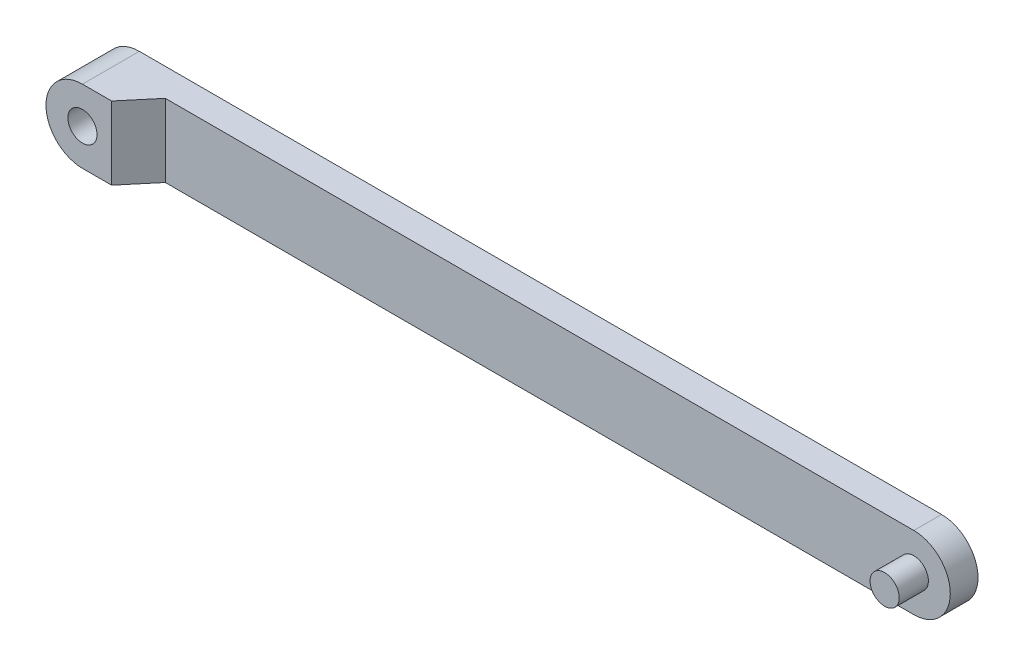
ISO-10303-21;
HEADER;
FILE_DESCRIPTION(('STEP AP214'),'2;1');
FILE_NAME('part.step','',(''),(''),'','','');
FILE_SCHEMA(('AUTOMOTIVE_DESIGN { 1 0 10303 214 1 1 1 1 }'));
ENDSEC;
DATA;
#1=APPLICATION_CONTEXT('core data for automotive mechanical design processes');
#2=APPLICATION_PROTOCOL_DEFINITION('international standard','automotive_design',2000,#1);
#3=PRODUCT_CONTEXT('',#1,'mechanical');
#4=PRODUCT('Part','Part','',(#3));
#5=PRODUCT_RELATED_PRODUCT_CATEGORY('part','',(#4));
#6=PRODUCT_DEFINITION_FORMATION('','',#4);
#7=PRODUCT_DEFINITION_CONTEXT('part definition',#1,'design');
#8=PRODUCT_DEFINITION('design','',#6,#7);
#9=PRODUCT_DEFINITION_SHAPE('','',#8);
#10=(LENGTH_UNIT() NAMED_UNIT(*) SI_UNIT(.MILLI.,.METRE.));
#11=(NAMED_UNIT(*) PLANE_ANGLE_UNIT() SI_UNIT($,.RADIAN.));
#12=(NAMED_UNIT(*) SI_UNIT($,.STERADIAN.) SOLID_ANGLE_UNIT());
#13=UNCERTAINTY_MEASURE_WITH_UNIT(LENGTH_MEASURE(1.E-05),#10,'distance_accuracy_value','');
#14=(GEOMETRIC_REPRESENTATION_CONTEXT(3) GLOBAL_UNCERTAINTY_ASSIGNED_CONTEXT((#13)) GLOBAL_UNIT_ASSIGNED_CONTEXT((#10,
#11,#12)) REPRESENTATION_CONTEXT('',''));
#15=CARTESIAN_POINT('',(0.,0.,0.));
#16=DIRECTION('',(0.,0.,1.));
#17=DIRECTION('',(1.,0.,0.));
#18=AXIS2_PLACEMENT_3D('',#15,#16,#17);
#19=CARTESIAN_POINT('',(-293.390996311773,0.,29.5));
#20=DIRECTION('',(0.,0.,1.));
#21=DIRECTION('',(1.,0.,0.));
#22=AXIS2_PLACEMENT_3D('',#19,#20,#21);
#23=PLANE('',#22);
#24=DIRECTION('',(0.,-1.,0.));
#25=VECTOR('',#24,1.);
#26=CARTESIAN_POINT('',(-273.390996311773,25.,29.5));
#27=LINE('',#26,#25);
#28=CARTESIAN_POINT('',(-273.390996311773,25.,29.5));
#29=VERTEX_POINT('',#28);
#30=CARTESIAN_POINT('',(-273.390996311773,-25.,29.5));
#31=VERTEX_POINT('',#30);
#32=EDGE_CURVE('E117',#29,#31,#27,.T.);
#33=ORIENTED_EDGE('',*,*,#32,.F.);
#34=DIRECTION('',(-1.,0.,0.));
#35=VECTOR('',#34,1.);
#36=CARTESIAN_POINT('',(-293.390996311773,25.,29.5));
#37=LINE('',#36,#35);
#38=CARTESIAN_POINT('',(-293.390996311773,25.,29.5));
#39=VERTEX_POINT('',#38);
#40=EDGE_CURVE('E40',#29,#39,#37,.T.);
#41=ORIENTED_EDGE('',*,*,#40,.T.);
#42=CARTESIAN_POINT('',(-293.390996311773,0.,29.5));
#43=DIRECTION('',(0.,0.,1.));
#44=DIRECTION('',(1.,0.,0.));
#45=AXIS2_PLACEMENT_3D('',#42,#43,#44);
#46=CIRCLE('',#45,25.);
#47=CARTESIAN_POINT('',(-293.390996311773,-25.,29.5));
#48=VERTEX_POINT('',#47);
#49=EDGE_CURVE('E71',#39,#48,#46,.T.);
#50=ORIENTED_EDGE('',*,*,#49,.T.);
#51=DIRECTION('',(1.,0.,0.));
#52=VECTOR('',#51,1.);
#53=CARTESIAN_POINT('',(-293.390996311773,-25.,29.5));
#54=LINE('',#53,#52);
#55=EDGE_CURVE('E103',#48,#31,#54,.T.);
#56=ORIENTED_EDGE('',*,*,#55,.T.);
#57=EDGE_LOOP('',(#33,#41,#50,#56));
#58=FACE_BOUND('',#57,.T.);
#59=CARTESIAN_POINT('',(-293.390996311773,0.,29.5));
#60=DIRECTION('',(0.,0.,1.));
#61=DIRECTION('',(1.,0.,0.));
#62=AXIS2_PLACEMENT_3D('',#59,#60,#61);
#63=CIRCLE('',#62,9.99999999999998);
#64=CARTESIAN_POINT('',(-283.390996311773,0.,29.5));
#65=VERTEX_POINT('',#64);
#66=EDGE_CURVE('E83',#65,#65,#63,.T.);
#67=ORIENTED_EDGE('',*,*,#66,.F.);
#68=EDGE_LOOP('',(#67));
#69=FACE_BOUND('',#68,.T.);
#70=ADVANCED_FACE('F16',(#58,#69),#23,.T.);
#71=CARTESIAN_POINT('',(-293.390996311773,0.,-9.49999999999999));
#72=DIRECTION('',(0.,0.,1.));
#73=DIRECTION('',(1.,0.,0.));
#74=AXIS2_PLACEMENT_3D('',#71,#72,#73);
#75=PLANE('',#74);
#76=CARTESIAN_POINT('',(-293.390996311773,0.,-9.49999999999999));
#77=DIRECTION('',(0.,0.,1.));
#78=DIRECTION('',(1.,0.,0.));
#79=AXIS2_PLACEMENT_3D('',#76,#77,#78);
#80=CIRCLE('',#79,25.);
#81=CARTESIAN_POINT('',(-293.390996311773,25.,-9.49999999999999));
#82=VERTEX_POINT('',#81);
#83=CARTESIAN_POINT('',(-293.390996311773,-25.,-9.49999999999999));
#84=VERTEX_POINT('',#83);
#85=EDGE_CURVE('E77',#82,#84,#80,.T.);
#86=ORIENTED_EDGE('',*,*,#85,.F.);
#87=DIRECTION('',(-1.,0.,0.));
#88=VECTOR('',#87,1.);
#89=CARTESIAN_POINT('',(-293.390996311773,25.,-9.49999999999999));
#90=LINE('',#89,#88);
#91=CARTESIAN_POINT('',(256.609003688227,25.,-9.49999999999999));
#92=VERTEX_POINT('',#91);
#93=EDGE_CURVE('E59',#92,#82,#90,.T.);
#94=ORIENTED_EDGE('',*,*,#93,.F.);
#95=CARTESIAN_POINT('',(256.609003688227,0.,-9.49999999999999));
#96=DIRECTION('',(0.,0.,1.));
#97=DIRECTION('',(1.,0.,0.));
#98=AXIS2_PLACEMENT_3D('',#95,#96,#97);
#99=CIRCLE('',#98,25.);
#100=CARTESIAN_POINT('',(256.609003688227,-25.,-9.49999999999999));
#101=VERTEX_POINT('',#100);
#102=EDGE_CURVE('E72',#101,#92,#99,.T.);
#103=ORIENTED_EDGE('',*,*,#102,.F.);
#104=DIRECTION('',(1.,0.,0.));
#105=VECTOR('',#104,1.);
#106=CARTESIAN_POINT('',(-293.390996311773,-25.,-9.49999999999999));
#107=LINE('',#106,#105);
#108=EDGE_CURVE('E82',#84,#101,#107,.T.);
#109=ORIENTED_EDGE('',*,*,#108,.F.);
#110=EDGE_LOOP('',(#86,#94,#103,#109));
#111=FACE_BOUND('',#110,.T.);
#112=CARTESIAN_POINT('',(-293.390996311773,0.,-9.49999999999999));
#113=DIRECTION('',(0.,0.,1.));
#114=DIRECTION('',(1.,0.,0.));
#115=AXIS2_PLACEMENT_3D('',#112,#113,#114);
#116=CIRCLE('',#115,9.99999999999998);
#117=CARTESIAN_POINT('',(-283.390996311773,0.,-9.49999999999999));
#118=VERTEX_POINT('',#117);
#119=EDGE_CURVE('E87',#118,#118,#116,.T.);
#120=ORIENTED_EDGE('',*,*,#119,.T.);
#121=EDGE_LOOP('',(#120));
#122=FACE_BOUND('',#121,.T.);
#123=ADVANCED_FACE('F79',(#111,#122),#75,.F.);
#124=CARTESIAN_POINT('',(-293.390996311773,0.,29.5));
#125=DIRECTION('',(0.,0.,-1.));
#126=DIRECTION('',(-1.,0.,0.));
#127=AXIS2_PLACEMENT_3D('',#124,#125,#126);
#128=CYLINDRICAL_SURFACE('',#127,25.);
#129=ORIENTED_EDGE('',*,*,#85,.T.);
#130=DIRECTION('',(0.,0.,-1.));
#131=VECTOR('',#130,1.);
#132=CARTESIAN_POINT('',(-293.390996311773,-25.,29.5));
#133=LINE('',#132,#131);
#134=EDGE_CURVE('E10',#48,#84,#133,.T.);
#135=ORIENTED_EDGE('',*,*,#134,.F.);
#136=ORIENTED_EDGE('',*,*,#49,.F.);
#137=DIRECTION('',(0.,0.,-1.));
#138=VECTOR('',#137,1.);
#139=CARTESIAN_POINT('',(-293.390996311773,25.,29.5));
#140=LINE('',#139,#138);
#141=EDGE_CURVE('E63',#39,#82,#140,.T.);
#142=ORIENTED_EDGE('',*,*,#141,.T.);
#143=EDGE_LOOP('',(#129,#135,#136,#142));
#144=FACE_BOUND('',#143,.T.);
#145=ADVANCED_FACE('F18',(#144),#128,.T.);
#146=CARTESIAN_POINT('',(-293.390996311773,-25.,29.5));
#147=DIRECTION('',(0.,1.,0.));
#148=DIRECTION('',(0.,0.,1.));
#149=AXIS2_PLACEMENT_3D('',#146,#147,#148);
#150=PLANE('',#149);
#151=DIRECTION('',(0.,0.,-1.));
#152=VECTOR('',#151,1.);
#153=CARTESIAN_POINT('',(256.609003688227,-25.,29.5));
#154=LINE('',#153,#152);
#155=CARTESIAN_POINT('',(256.609003688227,-25.,9.50000000000001));
#156=VERTEX_POINT('',#155);
#157=EDGE_CURVE('E24',#156,#101,#154,.T.);
#158=ORIENTED_EDGE('',*,*,#157,.F.);
#159=DIRECTION('',(-1.,0.,0.));
#160=VECTOR('',#159,1.);
#161=CARTESIAN_POINT('',(-293.390996311773,-25.,9.49999999999999));
#162=LINE('',#161,#160);
#163=CARTESIAN_POINT('',(-256.609003688227,-25.,9.49999999999999));
#164=VERTEX_POINT('',#163);
#165=EDGE_CURVE('E111',#156,#164,#162,.T.);
#166=ORIENTED_EDGE('',*,*,#165,.T.);
#167=DIRECTION('',(-0.642787609686538,0.,0.766044443118979));
#168=VECTOR('',#167,1.);
#169=CARTESIAN_POINT('',(-281.654514535103,-25.,39.3480775301221));
#170=LINE('',#169,#168);
#171=EDGE_CURVE('E106',#164,#31,#170,.T.);
#172=ORIENTED_EDGE('',*,*,#171,.T.);
#173=ORIENTED_EDGE('',*,*,#55,.F.);
#174=ORIENTED_EDGE('',*,*,#134,.T.);
#175=ORIENTED_EDGE('',*,*,#108,.T.);
#176=EDGE_LOOP('',(#158,#166,#172,#173,#174,#175));
#177=FACE_BOUND('',#176,.T.);
#178=ADVANCED_FACE('F100',(#177),#150,.F.);
#179=CARTESIAN_POINT('',(256.609003688227,0.,29.5));
#180=DIRECTION('',(0.,0.,-1.));
#181=DIRECTION('',(-1.,0.,0.));
#182=AXIS2_PLACEMENT_3D('',#179,#180,#181);
#183=CYLINDRICAL_SURFACE('',#182,25.);
#184=DIRECTION('',(0.,0.,-1.));
#185=VECTOR('',#184,1.);
#186=CARTESIAN_POINT('',(256.609003688227,25.,29.5));
#187=LINE('',#186,#185);
#188=CARTESIAN_POINT('',(256.609003688227,25.,9.50000000000001));
#189=VERTEX_POINT('',#188);
#190=EDGE_CURVE('E66',#189,#92,#187,.T.);
#191=ORIENTED_EDGE('',*,*,#190,.F.);
#192=CARTESIAN_POINT('',(256.609003688227,0.,9.50000000000001));
#193=DIRECTION('',(0.,0.,-1.));
#194=DIRECTION('',(-1.,0.,0.));
#195=AXIS2_PLACEMENT_3D('',#192,#193,#194);
#196=CIRCLE('',#195,25.);
#197=EDGE_CURVE('E97',#189,#156,#196,.T.);
#198=ORIENTED_EDGE('',*,*,#197,.T.);
#199=ORIENTED_EDGE('',*,*,#157,.T.);
#200=ORIENTED_EDGE('',*,*,#102,.T.);
#201=EDGE_LOOP('',(#191,#198,#199,#200));
#202=FACE_BOUND('',#201,.T.);
#203=ADVANCED_FACE('F96',(#202),#183,.T.);
#204=CARTESIAN_POINT('',(-293.390996311773,25.,29.5));
#205=DIRECTION('',(0.,-1.,0.));
#206=DIRECTION('',(0.,0.,-1.));
#207=AXIS2_PLACEMENT_3D('',#204,#205,#206);
#208=PLANE('',#207);
#209=DIRECTION('',(0.642787609686538,0.,-0.766044443118979));
#210=VECTOR('',#209,1.);
#211=CARTESIAN_POINT('',(-256.609003688227,25.,9.49999999999999));
#212=LINE('',#211,#210);
#213=CARTESIAN_POINT('',(-256.609003688227,25.,9.49999999999999));
#214=VERTEX_POINT('',#213);
#215=EDGE_CURVE('E122',#29,#214,#212,.T.);
#216=ORIENTED_EDGE('',*,*,#215,.T.);
#217=DIRECTION('',(1.,0.,0.));
#218=VECTOR('',#217,1.);
#219=CARTESIAN_POINT('',(281.609003688227,25.,9.50000000000001));
#220=LINE('',#219,#218);
#221=EDGE_CURVE('E31',#214,#189,#220,.T.);
#222=ORIENTED_EDGE('',*,*,#221,.T.);
#223=ORIENTED_EDGE('',*,*,#190,.T.);
#224=ORIENTED_EDGE('',*,*,#93,.T.);
#225=ORIENTED_EDGE('',*,*,#141,.F.);
#226=ORIENTED_EDGE('',*,*,#40,.F.);
#227=EDGE_LOOP('',(#216,#222,#223,#224,#225,#226));
#228=FACE_BOUND('',#227,.T.);
#229=ADVANCED_FACE('F62',(#228),#208,.F.);
#230=CARTESIAN_POINT('',(-293.390996311773,0.,29.5));
#231=DIRECTION('',(0.,0.,-1.));
#232=DIRECTION('',(-1.,0.,0.));
#233=AXIS2_PLACEMENT_3D('',#230,#231,#232);
#234=CYLINDRICAL_SURFACE('',#233,9.99999999999998);
#235=ORIENTED_EDGE('',*,*,#66,.T.);
#236=EDGE_LOOP('',(#235));
#237=FACE_BOUND('',#236,.T.);
#238=ORIENTED_EDGE('',*,*,#119,.F.);
#239=EDGE_LOOP('',(#238));
#240=FACE_BOUND('',#239,.T.);
#241=ADVANCED_FACE('F150',(#237,#240),#234,.F.);
#242=CARTESIAN_POINT('',(281.609003688227,25.,9.50000000000001));
#243=DIRECTION('',(0.,0.,-1.));
#244=DIRECTION('',(-1.,0.,0.));
#245=AXIS2_PLACEMENT_3D('',#242,#243,#244);
#246=PLANE('',#245);
#247=CARTESIAN_POINT('',(256.609003688227,0.,9.49999999999998));
#248=DIRECTION('',(0.,0.,-1.));
#249=DIRECTION('',(-1.,0.,0.));
#250=AXIS2_PLACEMENT_3D('',#247,#248,#249);
#251=CIRCLE('',#250,9.99999999999998);
#252=CARTESIAN_POINT('',(246.609003688227,0.,9.49999999999998));
#253=VERTEX_POINT('',#252);
#254=EDGE_CURVE('E125',#253,#253,#251,.T.);
#255=ORIENTED_EDGE('',*,*,#254,.T.);
#256=EDGE_LOOP('',(#255));
#257=FACE_BOUND('',#256,.T.);
#258=ORIENTED_EDGE('',*,*,#197,.F.);
#259=ORIENTED_EDGE('',*,*,#221,.F.);
#260=DIRECTION('',(0.,-1.,0.));
#261=VECTOR('',#260,1.);
#262=CARTESIAN_POINT('',(-256.609003688227,25.,9.49999999999999));
#263=LINE('',#262,#261);
#264=EDGE_CURVE('E116',#214,#164,#263,.T.);
#265=ORIENTED_EDGE('',*,*,#264,.T.);
#266=ORIENTED_EDGE('',*,*,#165,.F.);
#267=EDGE_LOOP('',(#258,#259,#265,#266));
#268=FACE_BOUND('',#267,.T.);
#269=ADVANCED_FACE('F203',(#257,#268),#246,.F.);
#270=CARTESIAN_POINT('',(-256.609003688227,25.,9.49999999999999));
#271=DIRECTION('',(-0.766044443118979,0.,-0.642787609686538));
#272=DIRECTION('',(-0.642787609686538,0.,0.766044443118979));
#273=AXIS2_PLACEMENT_3D('',#270,#271,#272);
#274=PLANE('',#273);
#275=ORIENTED_EDGE('',*,*,#264,.F.);
#276=ORIENTED_EDGE('',*,*,#215,.F.);
#277=ORIENTED_EDGE('',*,*,#32,.T.);
#278=ORIENTED_EDGE('',*,*,#171,.F.);
#279=EDGE_LOOP('',(#275,#276,#277,#278));
#280=FACE_BOUND('',#279,.T.);
#281=ADVANCED_FACE('F141',(#280),#274,.F.);
#282=CARTESIAN_POINT('',(256.609003688227,0.,29.5));
#283=DIRECTION('',(0.,0.,-1.));
#284=DIRECTION('',(-1.,0.,0.));
#285=AXIS2_PLACEMENT_3D('',#282,#283,#284);
#286=CYLINDRICAL_SURFACE('',#285,9.99999999999998);
#287=CARTESIAN_POINT('',(256.609003688227,0.,29.5));
#288=DIRECTION('',(0.,0.,-1.));
#289=DIRECTION('',(-1.,0.,0.));
#290=AXIS2_PLACEMENT_3D('',#287,#288,#289);
#291=CIRCLE('',#290,9.99999999999998);
#292=CARTESIAN_POINT('',(246.609003688227,0.,29.5));
#293=VERTEX_POINT('',#292);
#294=EDGE_CURVE('E124',#293,#293,#291,.T.);
#295=ORIENTED_EDGE('',*,*,#294,.T.);
#296=EDGE_LOOP('',(#295));
#297=FACE_BOUND('',#296,.T.);
#298=ORIENTED_EDGE('',*,*,#254,.F.);
#299=EDGE_LOOP('',(#298));
#300=FACE_BOUND('',#299,.T.);
#301=ADVANCED_FACE('F131',(#297,#300),#286,.T.);
#302=CARTESIAN_POINT('',(256.609003688227,0.,29.5));
#303=DIRECTION('',(0.,0.,-1.));
#304=DIRECTION('',(-1.,0.,0.));
#305=AXIS2_PLACEMENT_3D('',#302,#303,#304);
#306=PLANE('',#305);
#307=ORIENTED_EDGE('',*,*,#294,.F.);
#308=EDGE_LOOP('',(#307));
#309=FACE_BOUND('',#308,.T.);
#310=ADVANCED_FACE('F134',(#309),#306,.F.);
#311=CLOSED_SHELL('',(#70,#123,#145,#178,#203,#229,#241,#269,#281,#301,#310));
#312=MANIFOLD_SOLID_BREP('B1',#311);
#313=ADVANCED_BREP_SHAPE_REPRESENTATION('',(#18,#312),#14);
#314=SHAPE_DEFINITION_REPRESENTATION(#9,#313);
ENDSEC;
END-ISO-10303-21;
